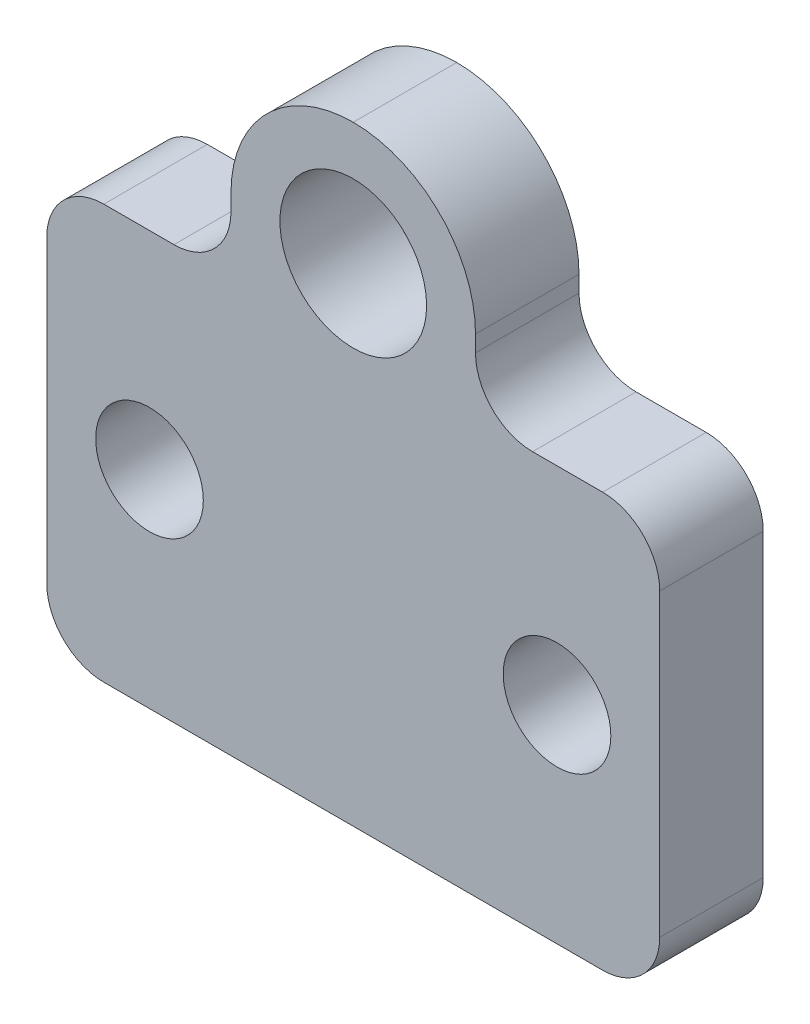
ISO-10303-21;
HEADER;
FILE_DESCRIPTION(('STEP AP214'),'2;1');
FILE_NAME('part.step','',(''),(''),'','','');
FILE_SCHEMA(('AUTOMOTIVE_DESIGN { 1 0 10303 214 1 1 1 1 }'));
ENDSEC;
DATA;
#1=APPLICATION_CONTEXT('core data for automotive mechanical design processes');
#2=APPLICATION_PROTOCOL_DEFINITION('international standard','automotive_design',2000,#1);
#3=PRODUCT_CONTEXT('',#1,'mechanical');
#4=PRODUCT('Part','Part','',(#3));
#5=PRODUCT_RELATED_PRODUCT_CATEGORY('part','',(#4));
#6=PRODUCT_DEFINITION_FORMATION('','',#4);
#7=PRODUCT_DEFINITION_CONTEXT('part definition',#1,'design');
#8=PRODUCT_DEFINITION('design','',#6,#7);
#9=PRODUCT_DEFINITION_SHAPE('','',#8);
#10=(LENGTH_UNIT() NAMED_UNIT(*) SI_UNIT(.MILLI.,.METRE.));
#11=(NAMED_UNIT(*) PLANE_ANGLE_UNIT() SI_UNIT($,.RADIAN.));
#12=(NAMED_UNIT(*) SI_UNIT($,.STERADIAN.) SOLID_ANGLE_UNIT());
#13=UNCERTAINTY_MEASURE_WITH_UNIT(LENGTH_MEASURE(1.E-05),#10,'distance_accuracy_value','');
#14=(GEOMETRIC_REPRESENTATION_CONTEXT(3) GLOBAL_UNCERTAINTY_ASSIGNED_CONTEXT((#13)) GLOBAL_UNIT_ASSIGNED_CONTEXT((#10,
#11,#12)) REPRESENTATION_CONTEXT('',''));
#15=CARTESIAN_POINT('',(0.,0.,0.));
#16=DIRECTION('',(0.,0.,1.));
#17=DIRECTION('',(1.,0.,0.));
#18=AXIS2_PLACEMENT_3D('',#15,#16,#17);
#19=CARTESIAN_POINT('',(0.,0.,6.35));
#20=DIRECTION('',(0.,0.,-1.));
#21=DIRECTION('',(-1.,0.,0.));
#22=AXIS2_PLACEMENT_3D('',#19,#20,#21);
#23=PLANE('',#22);
#24=DIRECTION('',(1.,0.,0.));
#25=VECTOR('',#24,1.);
#26=CARTESIAN_POINT('',(0.,0.,6.35));
#27=LINE('',#26,#25);
#28=CARTESIAN_POINT('',(3.5,0.,6.35));
#29=VERTEX_POINT('',#28);
#30=CARTESIAN_POINT('',(34.1,0.,6.35));
#31=VERTEX_POINT('',#30);
#32=EDGE_CURVE('E371',#29,#31,#27,.T.);
#33=ORIENTED_EDGE('',*,*,#32,.T.);
#34=CARTESIAN_POINT('',(34.1,3.5,6.35));
#35=DIRECTION('',(0.,0.,-1.));
#36=DIRECTION('',(-1.,0.,0.));
#37=AXIS2_PLACEMENT_3D('',#34,#35,#36);
#38=CIRCLE('',#37,3.5);
#39=CARTESIAN_POINT('',(37.6,3.5,6.35));
#40=VERTEX_POINT('',#39);
#41=EDGE_CURVE('E279',#31,#40,#38,.F.);
#42=ORIENTED_EDGE('',*,*,#41,.T.);
#43=DIRECTION('',(0.,1.,0.));
#44=VECTOR('',#43,1.);
#45=CARTESIAN_POINT('',(37.6,0.,6.35));
#46=LINE('',#45,#44);
#47=CARTESIAN_POINT('',(37.6,21.9,6.35));
#48=VERTEX_POINT('',#47);
#49=EDGE_CURVE('E209',#40,#48,#46,.T.);
#50=ORIENTED_EDGE('',*,*,#49,.T.);
#51=CARTESIAN_POINT('',(34.1,21.9,6.35));
#52=DIRECTION('',(0.,0.,-1.));
#53=DIRECTION('',(-1.,0.,0.));
#54=AXIS2_PLACEMENT_3D('',#51,#52,#53);
#55=CIRCLE('',#54,3.5);
#56=CARTESIAN_POINT('',(34.1,25.4,6.35));
#57=VERTEX_POINT('',#56);
#58=EDGE_CURVE('E276',#48,#57,#55,.F.);
#59=ORIENTED_EDGE('',*,*,#58,.T.);
#60=DIRECTION('',(-1.,0.,0.));
#61=VECTOR('',#60,1.);
#62=CARTESIAN_POINT('',(26.3,25.4,6.35));
#63=LINE('',#62,#61);
#64=CARTESIAN_POINT('',(29.8,25.4,6.35));
#65=VERTEX_POINT('',#64);
#66=EDGE_CURVE('E375',#57,#65,#63,.T.);
#67=ORIENTED_EDGE('',*,*,#66,.T.);
#68=CARTESIAN_POINT('',(29.8,28.9,6.35));
#69=DIRECTION('',(0.,0.,-1.));
#70=DIRECTION('',(-1.,0.,0.));
#71=AXIS2_PLACEMENT_3D('',#68,#69,#70);
#72=CIRCLE('',#71,3.5);
#73=CARTESIAN_POINT('',(26.3,28.9,6.35));
#74=VERTEX_POINT('',#73);
#75=EDGE_CURVE('E319',#65,#74,#72,.T.);
#76=ORIENTED_EDGE('',*,*,#75,.T.);
#77=DIRECTION('',(0.,1.,0.));
#78=VECTOR('',#77,1.);
#79=CARTESIAN_POINT('',(26.3,37.4,6.35));
#80=LINE('',#79,#78);
#81=CARTESIAN_POINT('',(26.3,29.9,6.35));
#82=VERTEX_POINT('',#81);
#83=EDGE_CURVE('E342',#74,#82,#80,.T.);
#84=ORIENTED_EDGE('',*,*,#83,.T.);
#85=CARTESIAN_POINT('',(18.8,29.9,6.35));
#86=DIRECTION('',(0.,0.,-1.));
#87=DIRECTION('',(-1.,0.,0.));
#88=AXIS2_PLACEMENT_3D('',#85,#86,#87);
#89=CIRCLE('',#88,7.5);
#90=CARTESIAN_POINT('',(18.8,37.4,6.35));
#91=VERTEX_POINT('',#90);
#92=EDGE_CURVE('E267',#82,#91,#89,.F.);
#93=ORIENTED_EDGE('',*,*,#92,.T.);
#94=CARTESIAN_POINT('',(18.8,29.9,6.35));
#95=DIRECTION('',(0.,0.,-1.));
#96=DIRECTION('',(-1.,0.,0.));
#97=AXIS2_PLACEMENT_3D('',#94,#95,#96);
#98=CIRCLE('',#97,7.5);
#99=CARTESIAN_POINT('',(11.3,29.9,6.35));
#100=VERTEX_POINT('',#99);
#101=EDGE_CURVE('E264',#91,#100,#98,.F.);
#102=ORIENTED_EDGE('',*,*,#101,.T.);
#103=DIRECTION('',(0.,-1.,0.));
#104=VECTOR('',#103,1.);
#105=CARTESIAN_POINT('',(11.3,25.4,6.35));
#106=LINE('',#105,#104);
#107=CARTESIAN_POINT('',(11.3,28.9,6.35));
#108=VERTEX_POINT('',#107);
#109=EDGE_CURVE('E337',#100,#108,#106,.T.);
#110=ORIENTED_EDGE('',*,*,#109,.T.);
#111=CARTESIAN_POINT('',(7.8,28.9,6.35));
#112=DIRECTION('',(0.,0.,-1.));
#113=DIRECTION('',(-1.,0.,0.));
#114=AXIS2_PLACEMENT_3D('',#111,#112,#113);
#115=CIRCLE('',#114,3.5);
#116=CARTESIAN_POINT('',(7.8,25.4,6.35));
#117=VERTEX_POINT('',#116);
#118=EDGE_CURVE('E12',#108,#117,#115,.T.);
#119=ORIENTED_EDGE('',*,*,#118,.T.);
#120=DIRECTION('',(-1.,0.,0.));
#121=VECTOR('',#120,1.);
#122=CARTESIAN_POINT('',(0.,25.4,6.35));
#123=LINE('',#122,#121);
#124=CARTESIAN_POINT('',(3.5,25.4,6.35));
#125=VERTEX_POINT('',#124);
#126=EDGE_CURVE('E244',#117,#125,#123,.T.);
#127=ORIENTED_EDGE('',*,*,#126,.T.);
#128=CARTESIAN_POINT('',(3.5,21.9,6.35));
#129=DIRECTION('',(0.,0.,-1.));
#130=DIRECTION('',(-1.,0.,0.));
#131=AXIS2_PLACEMENT_3D('',#128,#129,#130);
#132=CIRCLE('',#131,3.5);
#133=CARTESIAN_POINT('',(0.,21.9,6.35));
#134=VERTEX_POINT('',#133);
#135=EDGE_CURVE('E270',#125,#134,#132,.F.);
#136=ORIENTED_EDGE('',*,*,#135,.T.);
#137=DIRECTION('',(0.,-1.,0.));
#138=VECTOR('',#137,1.);
#139=CARTESIAN_POINT('',(0.,0.,6.35));
#140=LINE('',#139,#138);
#141=CARTESIAN_POINT('',(0.,3.5,6.35));
#142=VERTEX_POINT('',#141);
#143=EDGE_CURVE('E242',#134,#142,#140,.T.);
#144=ORIENTED_EDGE('',*,*,#143,.T.);
#145=CARTESIAN_POINT('',(3.5,3.5,6.35));
#146=DIRECTION('',(0.,0.,-1.));
#147=DIRECTION('',(-1.,0.,0.));
#148=AXIS2_PLACEMENT_3D('',#145,#146,#147);
#149=CIRCLE('',#148,3.5);
#150=EDGE_CURVE('E273',#142,#29,#149,.F.);
#151=ORIENTED_EDGE('',*,*,#150,.T.);
#152=EDGE_LOOP('',(#33,#42,#50,#59,#67,#76,#84,#93,#102,#110,#119,#127,#136,#144,#151));
#153=FACE_BOUND('',#152,.T.);
#154=CARTESIAN_POINT('',(18.8,29.9,6.35));
#155=DIRECTION('',(0.,0.,1.));
#156=DIRECTION('',(1.,0.,0.));
#157=AXIS2_PLACEMENT_3D('',#154,#155,#156);
#158=CIRCLE('',#157,4.5);
#159=CARTESIAN_POINT('',(23.3,29.9,6.35));
#160=VERTEX_POINT('',#159);
#161=EDGE_CURVE('E347',#160,#160,#158,.T.);
#162=ORIENTED_EDGE('',*,*,#161,.F.);
#163=EDGE_LOOP('',(#162));
#164=FACE_BOUND('',#163,.T.);
#165=CARTESIAN_POINT('',(6.3,12.7,6.35));
#166=DIRECTION('',(0.,0.,1.));
#167=DIRECTION('',(1.,0.,0.));
#168=AXIS2_PLACEMENT_3D('',#165,#166,#167);
#169=CIRCLE('',#168,3.302);
#170=CARTESIAN_POINT('',(9.602,12.7,6.35));
#171=VERTEX_POINT('',#170);
#172=EDGE_CURVE('E362',#171,#171,#169,.T.);
#173=ORIENTED_EDGE('',*,*,#172,.F.);
#174=EDGE_LOOP('',(#173));
#175=FACE_BOUND('',#174,.T.);
#176=CARTESIAN_POINT('',(31.3,12.7,6.35));
#177=DIRECTION('',(0.,0.,1.));
#178=DIRECTION('',(1.,0.,0.));
#179=AXIS2_PLACEMENT_3D('',#176,#177,#178);
#180=CIRCLE('',#179,3.30199999999998);
#181=CARTESIAN_POINT('',(34.602,12.7,6.35));
#182=VERTEX_POINT('',#181);
#183=EDGE_CURVE('E625',#182,#182,#180,.T.);
#184=ORIENTED_EDGE('',*,*,#183,.F.);
#185=EDGE_LOOP('',(#184));
#186=FACE_BOUND('',#185,.T.);
#187=ADVANCED_FACE('F49',(#153,#164,#175,#186),#23,.F.);
#188=CARTESIAN_POINT('',(0.,0.,0.));
#189=DIRECTION('',(0.,0.,-1.));
#190=DIRECTION('',(-1.,0.,0.));
#191=AXIS2_PLACEMENT_3D('',#188,#189,#190);
#192=PLANE('',#191);
#193=CARTESIAN_POINT('',(6.3,12.7,0.));
#194=DIRECTION('',(0.,0.,1.));
#195=DIRECTION('',(1.,0.,0.));
#196=AXIS2_PLACEMENT_3D('',#193,#194,#195);
#197=CIRCLE('',#196,3.302);
#198=CARTESIAN_POINT('',(9.602,12.7,0.));
#199=VERTEX_POINT('',#198);
#200=EDGE_CURVE('E365',#199,#199,#197,.T.);
#201=ORIENTED_EDGE('',*,*,#200,.T.);
#202=EDGE_LOOP('',(#201));
#203=FACE_BOUND('',#202,.T.);
#204=DIRECTION('',(0.,1.,0.));
#205=VECTOR('',#204,1.);
#206=CARTESIAN_POINT('',(37.6,0.,0.));
#207=LINE('',#206,#205);
#208=CARTESIAN_POINT('',(37.6,3.5,0.));
#209=VERTEX_POINT('',#208);
#210=CARTESIAN_POINT('',(37.6,21.9,0.));
#211=VERTEX_POINT('',#210);
#212=EDGE_CURVE('E206',#209,#211,#207,.T.);
#213=ORIENTED_EDGE('',*,*,#212,.F.);
#214=CARTESIAN_POINT('',(34.1,3.5,0.));
#215=DIRECTION('',(0.,0.,-1.));
#216=DIRECTION('',(-1.,0.,0.));
#217=AXIS2_PLACEMENT_3D('',#214,#215,#216);
#218=CIRCLE('',#217,3.5);
#219=CARTESIAN_POINT('',(34.1,0.,0.));
#220=VERTEX_POINT('',#219);
#221=EDGE_CURVE('E188',#209,#220,#218,.T.);
#222=ORIENTED_EDGE('',*,*,#221,.T.);
#223=DIRECTION('',(1.,0.,0.));
#224=VECTOR('',#223,1.);
#225=CARTESIAN_POINT('',(0.,0.,0.));
#226=LINE('',#225,#224);
#227=CARTESIAN_POINT('',(3.5,0.,0.));
#228=VERTEX_POINT('',#227);
#229=EDGE_CURVE('E219',#228,#220,#226,.T.);
#230=ORIENTED_EDGE('',*,*,#229,.F.);
#231=CARTESIAN_POINT('',(3.5,3.5,0.));
#232=DIRECTION('',(0.,0.,-1.));
#233=DIRECTION('',(-1.,0.,0.));
#234=AXIS2_PLACEMENT_3D('',#231,#232,#233);
#235=CIRCLE('',#234,3.5);
#236=CARTESIAN_POINT('',(0.,3.5,0.));
#237=VERTEX_POINT('',#236);
#238=EDGE_CURVE('E254',#228,#237,#235,.T.);
#239=ORIENTED_EDGE('',*,*,#238,.T.);
#240=DIRECTION('',(0.,-1.,0.));
#241=VECTOR('',#240,1.);
#242=CARTESIAN_POINT('',(0.,0.,0.));
#243=LINE('',#242,#241);
#244=CARTESIAN_POINT('',(0.,21.9,0.));
#245=VERTEX_POINT('',#244);
#246=EDGE_CURVE('E228',#245,#237,#243,.T.);
#247=ORIENTED_EDGE('',*,*,#246,.F.);
#248=CARTESIAN_POINT('',(3.5,21.9,0.));
#249=DIRECTION('',(0.,0.,-1.));
#250=DIRECTION('',(-1.,0.,0.));
#251=AXIS2_PLACEMENT_3D('',#248,#249,#250);
#252=CIRCLE('',#251,3.5);
#253=CARTESIAN_POINT('',(3.5,25.4,0.));
#254=VERTEX_POINT('',#253);
#255=EDGE_CURVE('E251',#245,#254,#252,.T.);
#256=ORIENTED_EDGE('',*,*,#255,.T.);
#257=DIRECTION('',(-1.,0.,0.));
#258=VECTOR('',#257,1.);
#259=CARTESIAN_POINT('',(0.,25.4,0.));
#260=LINE('',#259,#258);
#261=CARTESIAN_POINT('',(7.8,25.4,0.));
#262=VERTEX_POINT('',#261);
#263=EDGE_CURVE('E239',#262,#254,#260,.T.);
#264=ORIENTED_EDGE('',*,*,#263,.F.);
#265=CARTESIAN_POINT('',(7.8,28.9,0.));
#266=DIRECTION('',(0.,0.,-1.));
#267=DIRECTION('',(-1.,0.,0.));
#268=AXIS2_PLACEMENT_3D('',#265,#266,#267);
#269=CIRCLE('',#268,3.5);
#270=CARTESIAN_POINT('',(11.3,28.9,0.));
#271=VERTEX_POINT('',#270);
#272=EDGE_CURVE('E59',#262,#271,#269,.F.);
#273=ORIENTED_EDGE('',*,*,#272,.T.);
#274=DIRECTION('',(0.,-1.,0.));
#275=VECTOR('',#274,1.);
#276=CARTESIAN_POINT('',(11.3,25.4,0.));
#277=LINE('',#276,#275);
#278=CARTESIAN_POINT('',(11.3,29.9,0.));
#279=VERTEX_POINT('',#278);
#280=EDGE_CURVE('E235',#279,#271,#277,.T.);
#281=ORIENTED_EDGE('',*,*,#280,.F.);
#282=CARTESIAN_POINT('',(18.8,29.9,0.));
#283=DIRECTION('',(0.,0.,-1.));
#284=DIRECTION('',(-1.,0.,0.));
#285=AXIS2_PLACEMENT_3D('',#282,#283,#284);
#286=CIRCLE('',#285,7.5);
#287=CARTESIAN_POINT('',(18.8,37.4,0.));
#288=VERTEX_POINT('',#287);
#289=EDGE_CURVE('E211',#279,#288,#286,.T.);
#290=ORIENTED_EDGE('',*,*,#289,.T.);
#291=CARTESIAN_POINT('',(18.8,29.9,0.));
#292=DIRECTION('',(0.,0.,-1.));
#293=DIRECTION('',(-1.,0.,0.));
#294=AXIS2_PLACEMENT_3D('',#291,#292,#293);
#295=CIRCLE('',#294,7.5);
#296=CARTESIAN_POINT('',(26.3,29.9,0.));
#297=VERTEX_POINT('',#296);
#298=EDGE_CURVE('E248',#288,#297,#295,.T.);
#299=ORIENTED_EDGE('',*,*,#298,.T.);
#300=DIRECTION('',(0.,1.,0.));
#301=VECTOR('',#300,1.);
#302=CARTESIAN_POINT('',(26.3,37.4,0.));
#303=LINE('',#302,#301);
#304=CARTESIAN_POINT('',(26.3,28.9,0.));
#305=VERTEX_POINT('',#304);
#306=EDGE_CURVE('E225',#305,#297,#303,.T.);
#307=ORIENTED_EDGE('',*,*,#306,.F.);
#308=CARTESIAN_POINT('',(29.8,28.9,0.));
#309=DIRECTION('',(0.,0.,-1.));
#310=DIRECTION('',(-1.,0.,0.));
#311=AXIS2_PLACEMENT_3D('',#308,#309,#310);
#312=CIRCLE('',#311,3.5);
#313=CARTESIAN_POINT('',(29.8,25.4,0.));
#314=VERTEX_POINT('',#313);
#315=EDGE_CURVE('E316',#305,#314,#312,.F.);
#316=ORIENTED_EDGE('',*,*,#315,.T.);
#317=DIRECTION('',(-1.,0.,0.));
#318=VECTOR('',#317,1.);
#319=CARTESIAN_POINT('',(26.3,25.4,0.));
#320=LINE('',#319,#318);
#321=CARTESIAN_POINT('',(34.1,25.4,0.));
#322=VERTEX_POINT('',#321);
#323=EDGE_CURVE('E218',#322,#314,#320,.T.);
#324=ORIENTED_EDGE('',*,*,#323,.F.);
#325=CARTESIAN_POINT('',(34.1,21.9,0.));
#326=DIRECTION('',(0.,0.,-1.));
#327=DIRECTION('',(-1.,0.,0.));
#328=AXIS2_PLACEMENT_3D('',#325,#326,#327);
#329=CIRCLE('',#328,3.5);
#330=EDGE_CURVE('E200',#322,#211,#329,.T.);
#331=ORIENTED_EDGE('',*,*,#330,.T.);
#332=EDGE_LOOP('',(#213,#222,#230,#239,#247,#256,#264,#273,#281,#290,#299,#307,#316,#324,#331));
#333=FACE_BOUND('',#332,.T.);
#334=CARTESIAN_POINT('',(18.8,29.9,0.));
#335=DIRECTION('',(0.,0.,1.));
#336=DIRECTION('',(1.,0.,0.));
#337=AXIS2_PLACEMENT_3D('',#334,#335,#336);
#338=CIRCLE('',#337,4.5);
#339=CARTESIAN_POINT('',(23.3,29.9,0.));
#340=VERTEX_POINT('',#339);
#341=EDGE_CURVE('E355',#340,#340,#338,.T.);
#342=ORIENTED_EDGE('',*,*,#341,.T.);
#343=EDGE_LOOP('',(#342));
#344=FACE_BOUND('',#343,.T.);
#345=CARTESIAN_POINT('',(31.3,12.7,0.));
#346=DIRECTION('',(0.,0.,1.));
#347=DIRECTION('',(1.,0.,0.));
#348=AXIS2_PLACEMENT_3D('',#345,#346,#347);
#349=CIRCLE('',#348,3.30199999999998);
#350=CARTESIAN_POINT('',(34.602,12.7,0.));
#351=VERTEX_POINT('',#350);
#352=EDGE_CURVE('E621',#351,#351,#349,.T.);
#353=ORIENTED_EDGE('',*,*,#352,.T.);
#354=EDGE_LOOP('',(#353));
#355=FACE_BOUND('',#354,.T.);
#356=ADVANCED_FACE('F214',(#203,#333,#344,#355),#192,.T.);
#357=CARTESIAN_POINT('',(0.,0.,6.35));
#358=DIRECTION('',(1.,0.,0.));
#359=DIRECTION('',(0.,0.,-1.));
#360=AXIS2_PLACEMENT_3D('',#357,#358,#359);
#361=PLANE('',#360);
#362=ORIENTED_EDGE('',*,*,#246,.T.);
#363=DIRECTION('',(0.,0.,-1.));
#364=VECTOR('',#363,1.);
#365=CARTESIAN_POINT('',(0.,3.5,6.35));
#366=LINE('',#365,#364);
#367=EDGE_CURVE('E301',#237,#142,#366,.F.);
#368=ORIENTED_EDGE('',*,*,#367,.T.);
#369=ORIENTED_EDGE('',*,*,#143,.F.);
#370=DIRECTION('',(0.,0.,-1.));
#371=VECTOR('',#370,1.);
#372=CARTESIAN_POINT('',(0.,21.9,6.35));
#373=LINE('',#372,#371);
#374=EDGE_CURVE('E297',#134,#245,#373,.T.);
#375=ORIENTED_EDGE('',*,*,#374,.T.);
#376=EDGE_LOOP('',(#362,#368,#369,#375));
#377=FACE_BOUND('',#376,.T.);
#378=ADVANCED_FACE('F412',(#377),#361,.F.);
#379=CARTESIAN_POINT('',(0.,0.,6.35));
#380=DIRECTION('',(0.,1.,0.));
#381=DIRECTION('',(0.,0.,1.));
#382=AXIS2_PLACEMENT_3D('',#379,#380,#381);
#383=PLANE('',#382);
#384=ORIENTED_EDGE('',*,*,#229,.T.);
#385=DIRECTION('',(0.,0.,-1.));
#386=VECTOR('',#385,1.);
#387=CARTESIAN_POINT('',(34.1,0.,6.35));
#388=LINE('',#387,#386);
#389=EDGE_CURVE('E193',#220,#31,#388,.F.);
#390=ORIENTED_EDGE('',*,*,#389,.T.);
#391=ORIENTED_EDGE('',*,*,#32,.F.);
#392=DIRECTION('',(0.,0.,-1.));
#393=VECTOR('',#392,1.);
#394=CARTESIAN_POINT('',(3.5,0.,6.35));
#395=LINE('',#394,#393);
#396=EDGE_CURVE('E199',#29,#228,#395,.T.);
#397=ORIENTED_EDGE('',*,*,#396,.T.);
#398=EDGE_LOOP('',(#384,#390,#391,#397));
#399=FACE_BOUND('',#398,.T.);
#400=ADVANCED_FACE('F405',(#399),#383,.F.);
#401=CARTESIAN_POINT('',(37.6,0.,6.35));
#402=DIRECTION('',(-1.,0.,0.));
#403=DIRECTION('',(0.,0.,1.));
#404=AXIS2_PLACEMENT_3D('',#401,#402,#403);
#405=PLANE('',#404);
#406=ORIENTED_EDGE('',*,*,#49,.F.);
#407=DIRECTION('',(0.,0.,-1.));
#408=VECTOR('',#407,1.);
#409=CARTESIAN_POINT('',(37.6,3.5,6.35));
#410=LINE('',#409,#408);
#411=EDGE_CURVE('E192',#40,#209,#410,.T.);
#412=ORIENTED_EDGE('',*,*,#411,.T.);
#413=ORIENTED_EDGE('',*,*,#212,.T.);
#414=DIRECTION('',(0.,0.,-1.));
#415=VECTOR('',#414,1.);
#416=CARTESIAN_POINT('',(37.6,21.9,6.35));
#417=LINE('',#416,#415);
#418=EDGE_CURVE('E212',#211,#48,#417,.F.);
#419=ORIENTED_EDGE('',*,*,#418,.T.);
#420=EDGE_LOOP('',(#406,#412,#413,#419));
#421=FACE_BOUND('',#420,.T.);
#422=ADVANCED_FACE('F205',(#421),#405,.F.);
#423=CARTESIAN_POINT('',(26.3,25.4,6.35));
#424=DIRECTION('',(0.,-1.,0.));
#425=DIRECTION('',(1.,0.,0.));
#426=AXIS2_PLACEMENT_3D('',#423,#424,#425);
#427=PLANE('',#426);
#428=ORIENTED_EDGE('',*,*,#323,.T.);
#429=DIRECTION('',(0.,0.,-1.));
#430=VECTOR('',#429,1.);
#431=CARTESIAN_POINT('',(29.8,25.4,6.35));
#432=LINE('',#431,#430);
#433=EDGE_CURVE('E294',#314,#65,#432,.F.);
#434=ORIENTED_EDGE('',*,*,#433,.T.);
#435=ORIENTED_EDGE('',*,*,#66,.F.);
#436=DIRECTION('',(0.,0.,-1.));
#437=VECTOR('',#436,1.);
#438=CARTESIAN_POINT('',(34.1,25.4,6.35));
#439=LINE('',#438,#437);
#440=EDGE_CURVE('E290',#57,#322,#439,.T.);
#441=ORIENTED_EDGE('',*,*,#440,.T.);
#442=EDGE_LOOP('',(#428,#434,#435,#441));
#443=FACE_BOUND('',#442,.T.);
#444=ADVANCED_FACE('F395',(#443),#427,.F.);
#445=CARTESIAN_POINT('',(26.3,37.4,6.35));
#446=DIRECTION('',(-1.,0.,0.));
#447=DIRECTION('',(0.,0.,1.));
#448=AXIS2_PLACEMENT_3D('',#445,#446,#447);
#449=PLANE('',#448);
#450=ORIENTED_EDGE('',*,*,#83,.F.);
#451=DIRECTION('',(0.,0.,-1.));
#452=VECTOR('',#451,1.);
#453=CARTESIAN_POINT('',(26.3,28.9,0.));
#454=LINE('',#453,#452);
#455=EDGE_CURVE('E286',#74,#305,#454,.T.);
#456=ORIENTED_EDGE('',*,*,#455,.T.);
#457=ORIENTED_EDGE('',*,*,#306,.T.);
#458=DIRECTION('',(0.,0.,-1.));
#459=VECTOR('',#458,1.);
#460=CARTESIAN_POINT('',(26.3,29.9,6.35));
#461=LINE('',#460,#459);
#462=EDGE_CURVE('E282',#297,#82,#461,.F.);
#463=ORIENTED_EDGE('',*,*,#462,.T.);
#464=EDGE_LOOP('',(#450,#456,#457,#463));
#465=FACE_BOUND('',#464,.T.);
#466=ADVANCED_FACE('F388',(#465),#449,.F.);
#467=CARTESIAN_POINT('',(11.3,25.4,6.35));
#468=DIRECTION('',(1.,0.,0.));
#469=DIRECTION('',(0.,0.,-1.));
#470=AXIS2_PLACEMENT_3D('',#467,#468,#469);
#471=PLANE('',#470);
#472=ORIENTED_EDGE('',*,*,#280,.T.);
#473=DIRECTION('',(0.,0.,-1.));
#474=VECTOR('',#473,1.);
#475=CARTESIAN_POINT('',(11.3,28.9,6.35));
#476=LINE('',#475,#474);
#477=EDGE_CURVE('E313',#271,#108,#476,.F.);
#478=ORIENTED_EDGE('',*,*,#477,.T.);
#479=ORIENTED_EDGE('',*,*,#109,.F.);
#480=DIRECTION('',(0.,0.,-1.));
#481=VECTOR('',#480,1.);
#482=CARTESIAN_POINT('',(11.3,29.9,6.35));
#483=LINE('',#482,#481);
#484=EDGE_CURVE('E310',#100,#279,#483,.T.);
#485=ORIENTED_EDGE('',*,*,#484,.T.);
#486=EDGE_LOOP('',(#472,#478,#479,#485));
#487=FACE_BOUND('',#486,.T.);
#488=ADVANCED_FACE('F330',(#487),#471,.F.);
#489=CARTESIAN_POINT('',(0.,25.4,6.35));
#490=DIRECTION('',(0.,-1.,0.));
#491=DIRECTION('',(0.,0.,-1.));
#492=AXIS2_PLACEMENT_3D('',#489,#490,#491);
#493=PLANE('',#492);
#494=ORIENTED_EDGE('',*,*,#263,.T.);
#495=DIRECTION('',(0.,0.,-1.));
#496=VECTOR('',#495,1.);
#497=CARTESIAN_POINT('',(3.5,25.4,6.35));
#498=LINE('',#497,#496);
#499=EDGE_CURVE('E69',#254,#125,#498,.F.);
#500=ORIENTED_EDGE('',*,*,#499,.T.);
#501=ORIENTED_EDGE('',*,*,#126,.F.);
#502=DIRECTION('',(0.,0.,-1.));
#503=VECTOR('',#502,1.);
#504=CARTESIAN_POINT('',(7.8,25.4,0.));
#505=LINE('',#504,#503);
#506=EDGE_CURVE('E304',#117,#262,#505,.T.);
#507=ORIENTED_EDGE('',*,*,#506,.T.);
#508=EDGE_LOOP('',(#494,#500,#501,#507));
#509=FACE_BOUND('',#508,.T.);
#510=ADVANCED_FACE('F334',(#509),#493,.F.);
#511=CARTESIAN_POINT('',(18.8,29.9,6.35));
#512=DIRECTION('',(0.,0.,-1.));
#513=DIRECTION('',(-1.,0.,0.));
#514=AXIS2_PLACEMENT_3D('',#511,#512,#513);
#515=CYLINDRICAL_SURFACE('',#514,4.5);
#516=ORIENTED_EDGE('',*,*,#161,.T.);
#517=EDGE_LOOP('',(#516));
#518=FACE_BOUND('',#517,.T.);
#519=ORIENTED_EDGE('',*,*,#341,.F.);
#520=EDGE_LOOP('',(#519));
#521=FACE_BOUND('',#520,.T.);
#522=ADVANCED_FACE('F428',(#518,#521),#515,.F.);
#523=CARTESIAN_POINT('',(6.3,12.7,6.35));
#524=DIRECTION('',(0.,0.,-1.));
#525=DIRECTION('',(-1.,0.,0.));
#526=AXIS2_PLACEMENT_3D('',#523,#524,#525);
#527=CYLINDRICAL_SURFACE('',#526,3.302);
#528=ORIENTED_EDGE('',*,*,#172,.T.);
#529=EDGE_LOOP('',(#528));
#530=FACE_BOUND('',#529,.T.);
#531=ORIENTED_EDGE('',*,*,#200,.F.);
#532=EDGE_LOOP('',(#531));
#533=FACE_BOUND('',#532,.T.);
#534=ADVANCED_FACE('F461',(#530,#533),#527,.F.);
#535=CARTESIAN_POINT('',(31.3,12.7,6.35));
#536=DIRECTION('',(0.,0.,-1.));
#537=DIRECTION('',(-1.,0.,0.));
#538=AXIS2_PLACEMENT_3D('',#535,#536,#537);
#539=CYLINDRICAL_SURFACE('',#538,3.30199999999998);
#540=ORIENTED_EDGE('',*,*,#183,.T.);
#541=EDGE_LOOP('',(#540));
#542=FACE_BOUND('',#541,.T.);
#543=ORIENTED_EDGE('',*,*,#352,.F.);
#544=EDGE_LOOP('',(#543));
#545=FACE_BOUND('',#544,.T.);
#546=ADVANCED_FACE('F466',(#542,#545),#539,.F.);
#547=CARTESIAN_POINT('',(34.1,3.5,6.35));
#548=DIRECTION('',(0.,0.,-1.));
#549=DIRECTION('',(-1.,0.,0.));
#550=AXIS2_PLACEMENT_3D('',#547,#548,#549);
#551=CYLINDRICAL_SURFACE('',#550,3.5);
#552=ORIENTED_EDGE('',*,*,#41,.F.);
#553=ORIENTED_EDGE('',*,*,#389,.F.);
#554=ORIENTED_EDGE('',*,*,#221,.F.);
#555=ORIENTED_EDGE('',*,*,#411,.F.);
#556=EDGE_LOOP('',(#552,#553,#554,#555));
#557=FACE_BOUND('',#556,.T.);
#558=ADVANCED_FACE('F191',(#557),#551,.T.);
#559=CARTESIAN_POINT('',(29.8,28.9,6.35));
#560=DIRECTION('',(0.,0.,1.));
#561=DIRECTION('',(1.,0.,0.));
#562=AXIS2_PLACEMENT_3D('',#559,#560,#561);
#563=CYLINDRICAL_SURFACE('',#562,3.5);
#564=ORIENTED_EDGE('',*,*,#75,.F.);
#565=ORIENTED_EDGE('',*,*,#433,.F.);
#566=ORIENTED_EDGE('',*,*,#315,.F.);
#567=ORIENTED_EDGE('',*,*,#455,.F.);
#568=EDGE_LOOP('',(#564,#565,#566,#567));
#569=FACE_BOUND('',#568,.T.);
#570=ADVANCED_FACE('F392',(#569),#563,.F.);
#571=CARTESIAN_POINT('',(34.1,21.9,6.35));
#572=DIRECTION('',(0.,0.,-1.));
#573=DIRECTION('',(-1.,0.,0.));
#574=AXIS2_PLACEMENT_3D('',#571,#572,#573);
#575=CYLINDRICAL_SURFACE('',#574,3.5);
#576=ORIENTED_EDGE('',*,*,#58,.F.);
#577=ORIENTED_EDGE('',*,*,#418,.F.);
#578=ORIENTED_EDGE('',*,*,#330,.F.);
#579=ORIENTED_EDGE('',*,*,#440,.F.);
#580=EDGE_LOOP('',(#576,#577,#578,#579));
#581=FACE_BOUND('',#580,.T.);
#582=ADVANCED_FACE('F400',(#581),#575,.T.);
#583=CARTESIAN_POINT('',(3.5,3.5,6.35));
#584=DIRECTION('',(0.,0.,-1.));
#585=DIRECTION('',(-1.,0.,0.));
#586=AXIS2_PLACEMENT_3D('',#583,#584,#585);
#587=CYLINDRICAL_SURFACE('',#586,3.5);
#588=ORIENTED_EDGE('',*,*,#150,.F.);
#589=ORIENTED_EDGE('',*,*,#367,.F.);
#590=ORIENTED_EDGE('',*,*,#238,.F.);
#591=ORIENTED_EDGE('',*,*,#396,.F.);
#592=EDGE_LOOP('',(#588,#589,#590,#591));
#593=FACE_BOUND('',#592,.T.);
#594=ADVANCED_FACE('F407',(#593),#587,.T.);
#595=CARTESIAN_POINT('',(3.5,21.9,6.35));
#596=DIRECTION('',(0.,0.,-1.));
#597=DIRECTION('',(-1.,0.,0.));
#598=AXIS2_PLACEMENT_3D('',#595,#596,#597);
#599=CYLINDRICAL_SURFACE('',#598,3.5);
#600=ORIENTED_EDGE('',*,*,#135,.F.);
#601=ORIENTED_EDGE('',*,*,#499,.F.);
#602=ORIENTED_EDGE('',*,*,#255,.F.);
#603=ORIENTED_EDGE('',*,*,#374,.F.);
#604=EDGE_LOOP('',(#600,#601,#602,#603));
#605=FACE_BOUND('',#604,.T.);
#606=ADVANCED_FACE('F410',(#605),#599,.T.);
#607=CARTESIAN_POINT('',(7.8,28.9,6.35));
#608=DIRECTION('',(0.,0.,1.));
#609=DIRECTION('',(1.,0.,0.));
#610=AXIS2_PLACEMENT_3D('',#607,#608,#609);
#611=CYLINDRICAL_SURFACE('',#610,3.5);
#612=ORIENTED_EDGE('',*,*,#118,.F.);
#613=ORIENTED_EDGE('',*,*,#477,.F.);
#614=ORIENTED_EDGE('',*,*,#272,.F.);
#615=ORIENTED_EDGE('',*,*,#506,.F.);
#616=EDGE_LOOP('',(#612,#613,#614,#615));
#617=FACE_BOUND('',#616,.T.);
#618=ADVANCED_FACE('F333',(#617),#611,.F.);
#619=CARTESIAN_POINT('',(18.8,29.9,6.35));
#620=DIRECTION('',(0.,0.,-1.));
#621=DIRECTION('',(-1.,0.,0.));
#622=AXIS2_PLACEMENT_3D('',#619,#620,#621);
#623=CYLINDRICAL_SURFACE('',#622,7.5);
#624=ORIENTED_EDGE('',*,*,#484,.F.);
#625=ORIENTED_EDGE('',*,*,#101,.F.);
#626=DIRECTION('',(0.,0.,-1.));
#627=VECTOR('',#626,1.);
#628=CARTESIAN_POINT('',(18.8,37.4,6.35));
#629=LINE('',#628,#627);
#630=EDGE_CURVE('E53',#288,#91,#629,.F.);
#631=ORIENTED_EDGE('',*,*,#630,.F.);
#632=ORIENTED_EDGE('',*,*,#289,.F.);
#633=EDGE_LOOP('',(#624,#625,#631,#632));
#634=FACE_BOUND('',#633,.T.);
#635=ADVANCED_FACE('F51',(#634),#623,.T.);
#636=CARTESIAN_POINT('',(18.8,29.9,6.35));
#637=DIRECTION('',(0.,0.,-1.));
#638=DIRECTION('',(-1.,0.,0.));
#639=AXIS2_PLACEMENT_3D('',#636,#637,#638);
#640=CYLINDRICAL_SURFACE('',#639,7.5);
#641=ORIENTED_EDGE('',*,*,#92,.F.);
#642=ORIENTED_EDGE('',*,*,#462,.F.);
#643=ORIENTED_EDGE('',*,*,#298,.F.);
#644=ORIENTED_EDGE('',*,*,#630,.T.);
#645=EDGE_LOOP('',(#641,#642,#643,#644));
#646=FACE_BOUND('',#645,.T.);
#647=ADVANCED_FACE('F507',(#646),#640,.T.);
#648=CLOSED_SHELL('',(#187,#356,#378,#400,#422,#444,#466,#488,#510,#522,#534,#546,#558,#570,
#582,#594,#606,#618,#635,#647));
#649=MANIFOLD_SOLID_BREP('B2',#648);
#650=ADVANCED_BREP_SHAPE_REPRESENTATION('',(#18,#649),#14);
#651=SHAPE_DEFINITION_REPRESENTATION(#9,#650);
ENDSEC;
END-ISO-10303-21;
